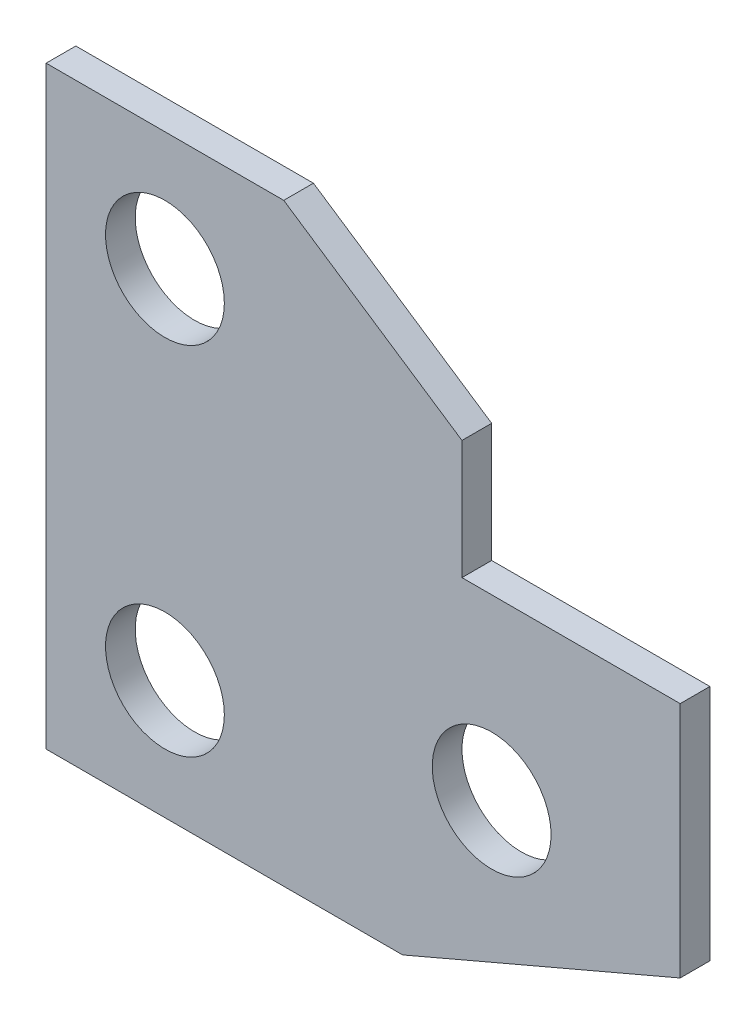
ISO-10303-21;
HEADER;
FILE_DESCRIPTION(('STEP AP214'),'2;1');
FILE_NAME('part.step','',(''),(''),'','','');
FILE_SCHEMA(('AUTOMOTIVE_DESIGN { 1 0 10303 214 1 1 1 1 }'));
ENDSEC;
DATA;
#1=APPLICATION_CONTEXT('core data for automotive mechanical design processes');
#2=APPLICATION_PROTOCOL_DEFINITION('international standard','automotive_design',2000,#1);
#3=PRODUCT_CONTEXT('',#1,'mechanical');
#4=PRODUCT('Part','Part','',(#3));
#5=PRODUCT_RELATED_PRODUCT_CATEGORY('part','',(#4));
#6=PRODUCT_DEFINITION_FORMATION('','',#4);
#7=PRODUCT_DEFINITION_CONTEXT('part definition',#1,'design');
#8=PRODUCT_DEFINITION('design','',#6,#7);
#9=PRODUCT_DEFINITION_SHAPE('','',#8);
#10=(LENGTH_UNIT() NAMED_UNIT(*) SI_UNIT(.MILLI.,.METRE.));
#11=(NAMED_UNIT(*) PLANE_ANGLE_UNIT() SI_UNIT($,.RADIAN.));
#12=(NAMED_UNIT(*) SI_UNIT($,.STERADIAN.) SOLID_ANGLE_UNIT());
#13=UNCERTAINTY_MEASURE_WITH_UNIT(LENGTH_MEASURE(1.E-05),#10,'distance_accuracy_value','');
#14=(GEOMETRIC_REPRESENTATION_CONTEXT(3) GLOBAL_UNCERTAINTY_ASSIGNED_CONTEXT((#13)) GLOBAL_UNIT_ASSIGNED_CONTEXT((#10,
#11,#12)) REPRESENTATION_CONTEXT('',''));
#15=CARTESIAN_POINT('',(0.,0.,0.));
#16=DIRECTION('',(0.,0.,1.));
#17=DIRECTION('',(1.,0.,0.));
#18=AXIS2_PLACEMENT_3D('',#15,#16,#17);
#19=CARTESIAN_POINT('',(0.,0.,5.));
#20=DIRECTION('',(0.,0.,-1.));
#21=DIRECTION('',(-1.,0.,0.));
#22=AXIS2_PLACEMENT_3D('',#19,#20,#21);
#23=PLANE('',#22);
#24=DIRECTION('',(0.,-1.,0.));
#25=VECTOR('',#24,1.);
#26=CARTESIAN_POINT('',(-146.847208950669,6.23541792753066,5.));
#27=LINE('',#26,#25);
#28=CARTESIAN_POINT('',(-146.847208950669,106.235417927531,5.));
#29=VERTEX_POINT('',#28);
#30=CARTESIAN_POINT('',(-146.847208950669,6.23541792753066,5.));
#31=VERTEX_POINT('',#30);
#32=EDGE_CURVE('E168',#29,#31,#27,.T.);
#33=ORIENTED_EDGE('',*,*,#32,.T.);
#34=DIRECTION('',(1.,0.,0.));
#35=VECTOR('',#34,1.);
#36=CARTESIAN_POINT('',(-86.8472089506691,6.23541792753067,5.));
#37=LINE('',#36,#35);
#38=CARTESIAN_POINT('',(-86.8472089506691,6.23541792753067,5.));
#39=VERTEX_POINT('',#38);
#40=EDGE_CURVE('E104',#31,#39,#37,.T.);
#41=ORIENTED_EDGE('',*,*,#40,.T.);
#42=DIRECTION('',(0.919347733087275,0.393445988246531,0.));
#43=VECTOR('',#42,1.);
#44=CARTESIAN_POINT('',(-40.1140989151835,26.2354179275307,5.));
#45=LINE('',#44,#43);
#46=CARTESIAN_POINT('',(-40.1140989151835,26.2354179275307,5.));
#47=VERTEX_POINT('',#46);
#48=EDGE_CURVE('E189',#39,#47,#45,.T.);
#49=ORIENTED_EDGE('',*,*,#48,.T.);
#50=DIRECTION('',(0.,1.,0.));
#51=VECTOR('',#50,1.);
#52=CARTESIAN_POINT('',(-40.1140989151835,66.2354179275307,5.));
#53=LINE('',#52,#51);
#54=CARTESIAN_POINT('',(-40.1140989151835,66.2354179275307,5.));
#55=VERTEX_POINT('',#54);
#56=EDGE_CURVE('E203',#47,#55,#53,.T.);
#57=ORIENTED_EDGE('',*,*,#56,.T.);
#58=DIRECTION('',(-1.,0.,0.));
#59=VECTOR('',#58,1.);
#60=CARTESIAN_POINT('',(-76.8472089506691,66.2354179275307,5.));
#61=LINE('',#60,#59);
#62=CARTESIAN_POINT('',(-76.8472089506691,66.2354179275307,5.));
#63=VERTEX_POINT('',#62);
#64=EDGE_CURVE('E123',#55,#63,#61,.T.);
#65=ORIENTED_EDGE('',*,*,#64,.T.);
#66=DIRECTION('',(0.,1.,0.));
#67=VECTOR('',#66,1.);
#68=CARTESIAN_POINT('',(-76.8472089506691,86.2354179275307,5.));
#69=LINE('',#68,#67);
#70=CARTESIAN_POINT('',(-76.8472089506691,86.2354179275307,5.));
#71=VERTEX_POINT('',#70);
#72=EDGE_CURVE('E117',#63,#71,#69,.T.);
#73=ORIENTED_EDGE('',*,*,#72,.T.);
#74=DIRECTION('',(-0.832050294337843,0.554700196225229,0.));
#75=VECTOR('',#74,1.);
#76=CARTESIAN_POINT('',(-106.847208950669,106.235417927531,5.));
#77=LINE('',#76,#75);
#78=CARTESIAN_POINT('',(-106.847208950669,106.235417927531,5.));
#79=VERTEX_POINT('',#78);
#80=EDGE_CURVE('E121',#71,#79,#77,.T.);
#81=ORIENTED_EDGE('',*,*,#80,.T.);
#82=DIRECTION('',(-1.,0.,0.));
#83=VECTOR('',#82,1.);
#84=CARTESIAN_POINT('',(-146.847208950669,106.235417927531,5.));
#85=LINE('',#84,#83);
#86=EDGE_CURVE('E61',#79,#29,#85,.T.);
#87=ORIENTED_EDGE('',*,*,#86,.T.);
#88=EDGE_LOOP('',(#33,#41,#49,#57,#65,#73,#81,#87));
#89=FACE_BOUND('',#88,.T.);
#90=CARTESIAN_POINT('',(-126.847208950669,86.2354179275307,5.));
#91=DIRECTION('',(0.,0.,1.));
#92=DIRECTION('',(1.,0.,0.));
#93=AXIS2_PLACEMENT_3D('',#90,#91,#92);
#94=CIRCLE('',#93,9.99999999999999);
#95=CARTESIAN_POINT('',(-116.847208950669,86.2354179275307,5.));
#96=VERTEX_POINT('',#95);
#97=EDGE_CURVE('E150',#96,#96,#94,.T.);
#98=ORIENTED_EDGE('',*,*,#97,.F.);
#99=EDGE_LOOP('',(#98));
#100=FACE_BOUND('',#99,.T.);
#101=CARTESIAN_POINT('',(-126.847208950669,26.2354179275307,5.));
#102=DIRECTION('',(0.,0.,1.));
#103=DIRECTION('',(1.,0.,0.));
#104=AXIS2_PLACEMENT_3D('',#101,#102,#103);
#105=CIRCLE('',#104,9.99999999999999);
#106=CARTESIAN_POINT('',(-116.847208950669,26.2354179275307,5.));
#107=VERTEX_POINT('',#106);
#108=EDGE_CURVE('E217',#107,#107,#105,.T.);
#109=ORIENTED_EDGE('',*,*,#108,.F.);
#110=EDGE_LOOP('',(#109));
#111=FACE_BOUND('',#110,.T.);
#112=CARTESIAN_POINT('',(-71.8472089506691,36.2354179275307,5.));
#113=DIRECTION('',(0.,0.,1.));
#114=DIRECTION('',(1.,0.,0.));
#115=AXIS2_PLACEMENT_3D('',#112,#113,#114);
#116=CIRCLE('',#115,10.);
#117=CARTESIAN_POINT('',(-61.8472089506691,36.2354179275307,5.));
#118=VERTEX_POINT('',#117);
#119=EDGE_CURVE('E225',#118,#118,#116,.T.);
#120=ORIENTED_EDGE('',*,*,#119,.F.);
#121=EDGE_LOOP('',(#120));
#122=FACE_BOUND('',#121,.T.);
#123=ADVANCED_FACE('F43',(#89,#100,#111,#122),#23,.F.);
#124=CARTESIAN_POINT('',(0.,0.,0.));
#125=DIRECTION('',(0.,0.,-1.));
#126=DIRECTION('',(-1.,0.,0.));
#127=AXIS2_PLACEMENT_3D('',#124,#125,#126);
#128=PLANE('',#127);
#129=CARTESIAN_POINT('',(-126.847208950669,26.2354179275307,0.));
#130=DIRECTION('',(0.,0.,1.));
#131=DIRECTION('',(1.,0.,0.));
#132=AXIS2_PLACEMENT_3D('',#129,#130,#131);
#133=CIRCLE('',#132,9.99999999999999);
#134=CARTESIAN_POINT('',(-116.847208950669,26.2354179275307,0.));
#135=VERTEX_POINT('',#134);
#136=EDGE_CURVE('E221',#135,#135,#133,.T.);
#137=ORIENTED_EDGE('',*,*,#136,.T.);
#138=EDGE_LOOP('',(#137));
#139=FACE_BOUND('',#138,.T.);
#140=DIRECTION('',(0.,-1.,0.));
#141=VECTOR('',#140,1.);
#142=CARTESIAN_POINT('',(-146.847208950669,6.23541792753066,0.));
#143=LINE('',#142,#141);
#144=CARTESIAN_POINT('',(-146.847208950669,106.235417927531,0.));
#145=VERTEX_POINT('',#144);
#146=CARTESIAN_POINT('',(-146.847208950669,6.23541792753066,0.));
#147=VERTEX_POINT('',#146);
#148=EDGE_CURVE('E145',#145,#147,#143,.T.);
#149=ORIENTED_EDGE('',*,*,#148,.F.);
#150=DIRECTION('',(-1.,0.,0.));
#151=VECTOR('',#150,1.);
#152=CARTESIAN_POINT('',(-146.847208950669,106.235417927531,0.));
#153=LINE('',#152,#151);
#154=CARTESIAN_POINT('',(-106.847208950669,106.235417927531,0.));
#155=VERTEX_POINT('',#154);
#156=EDGE_CURVE('E96',#155,#145,#153,.T.);
#157=ORIENTED_EDGE('',*,*,#156,.F.);
#158=DIRECTION('',(-0.832050294337843,0.554700196225229,0.));
#159=VECTOR('',#158,1.);
#160=CARTESIAN_POINT('',(-106.847208950669,106.235417927531,0.));
#161=LINE('',#160,#159);
#162=CARTESIAN_POINT('',(-76.8472089506691,86.2354179275307,0.));
#163=VERTEX_POINT('',#162);
#164=EDGE_CURVE('E90',#163,#155,#161,.T.);
#165=ORIENTED_EDGE('',*,*,#164,.F.);
#166=DIRECTION('',(0.,1.,0.));
#167=VECTOR('',#166,1.);
#168=CARTESIAN_POINT('',(-76.8472089506691,86.2354179275307,0.));
#169=LINE('',#168,#167);
#170=CARTESIAN_POINT('',(-76.8472089506691,66.2354179275307,0.));
#171=VERTEX_POINT('',#170);
#172=EDGE_CURVE('E132',#171,#163,#169,.T.);
#173=ORIENTED_EDGE('',*,*,#172,.F.);
#174=DIRECTION('',(-1.,0.,0.));
#175=VECTOR('',#174,1.);
#176=CARTESIAN_POINT('',(-76.8472089506691,66.2354179275307,0.));
#177=LINE('',#176,#175);
#178=CARTESIAN_POINT('',(-40.1140989151835,66.2354179275307,0.));
#179=VERTEX_POINT('',#178);
#180=EDGE_CURVE('E159',#179,#171,#177,.T.);
#181=ORIENTED_EDGE('',*,*,#180,.F.);
#182=DIRECTION('',(0.,1.,0.));
#183=VECTOR('',#182,1.);
#184=CARTESIAN_POINT('',(-40.1140989151835,66.2354179275307,0.));
#185=LINE('',#184,#183);
#186=CARTESIAN_POINT('',(-40.1140989151835,26.2354179275307,0.));
#187=VERTEX_POINT('',#186);
#188=EDGE_CURVE('E156',#187,#179,#185,.T.);
#189=ORIENTED_EDGE('',*,*,#188,.F.);
#190=DIRECTION('',(0.919347733087275,0.393445988246531,0.));
#191=VECTOR('',#190,1.);
#192=CARTESIAN_POINT('',(-40.1140989151835,26.2354179275307,0.));
#193=LINE('',#192,#191);
#194=CARTESIAN_POINT('',(-86.8472089506691,6.23541792753067,0.));
#195=VERTEX_POINT('',#194);
#196=EDGE_CURVE('E153',#195,#187,#193,.T.);
#197=ORIENTED_EDGE('',*,*,#196,.F.);
#198=DIRECTION('',(1.,0.,0.));
#199=VECTOR('',#198,1.);
#200=CARTESIAN_POINT('',(-86.8472089506691,6.23541792753067,0.));
#201=LINE('',#200,#199);
#202=EDGE_CURVE('E149',#147,#195,#201,.T.);
#203=ORIENTED_EDGE('',*,*,#202,.F.);
#204=EDGE_LOOP('',(#149,#157,#165,#173,#181,#189,#197,#203));
#205=FACE_BOUND('',#204,.T.);
#206=CARTESIAN_POINT('',(-126.847208950669,86.2354179275307,0.));
#207=DIRECTION('',(0.,0.,1.));
#208=DIRECTION('',(1.,0.,0.));
#209=AXIS2_PLACEMENT_3D('',#206,#207,#208);
#210=CIRCLE('',#209,9.99999999999999);
#211=CARTESIAN_POINT('',(-116.847208950669,86.2354179275307,0.));
#212=VERTEX_POINT('',#211);
#213=EDGE_CURVE('E213',#212,#212,#210,.T.);
#214=ORIENTED_EDGE('',*,*,#213,.T.);
#215=EDGE_LOOP('',(#214));
#216=FACE_BOUND('',#215,.T.);
#217=CARTESIAN_POINT('',(-71.8472089506691,36.2354179275307,0.));
#218=DIRECTION('',(0.,0.,1.));
#219=DIRECTION('',(1.,0.,0.));
#220=AXIS2_PLACEMENT_3D('',#217,#218,#219);
#221=CIRCLE('',#220,10.);
#222=CARTESIAN_POINT('',(-61.8472089506691,36.2354179275307,0.));
#223=VERTEX_POINT('',#222);
#224=EDGE_CURVE('E229',#223,#223,#221,.T.);
#225=ORIENTED_EDGE('',*,*,#224,.T.);
#226=EDGE_LOOP('',(#225));
#227=FACE_BOUND('',#226,.T.);
#228=ADVANCED_FACE('F193',(#139,#205,#216,#227),#128,.T.);
#229=CARTESIAN_POINT('',(-146.847208950669,6.23541792753066,5.));
#230=DIRECTION('',(1.,0.,0.));
#231=DIRECTION('',(0.,0.,-1.));
#232=AXIS2_PLACEMENT_3D('',#229,#230,#231);
#233=PLANE('',#232);
#234=ORIENTED_EDGE('',*,*,#148,.T.);
#235=DIRECTION('',(0.,0.,-1.));
#236=VECTOR('',#235,1.);
#237=CARTESIAN_POINT('',(-146.847208950669,6.23541792753066,5.));
#238=LINE('',#237,#236);
#239=EDGE_CURVE('E11',#31,#147,#238,.T.);
#240=ORIENTED_EDGE('',*,*,#239,.F.);
#241=ORIENTED_EDGE('',*,*,#32,.F.);
#242=DIRECTION('',(0.,0.,-1.));
#243=VECTOR('',#242,1.);
#244=CARTESIAN_POINT('',(-146.847208950669,106.235417927531,5.));
#245=LINE('',#244,#243);
#246=EDGE_CURVE('E141',#29,#145,#245,.T.);
#247=ORIENTED_EDGE('',*,*,#246,.T.);
#248=EDGE_LOOP('',(#234,#240,#241,#247));
#249=FACE_BOUND('',#248,.T.);
#250=ADVANCED_FACE('F45',(#249),#233,.F.);
#251=CARTESIAN_POINT('',(-86.8472089506691,6.23541792753067,5.));
#252=DIRECTION('',(0.,1.,0.));
#253=DIRECTION('',(-1.,0.,0.));
#254=AXIS2_PLACEMENT_3D('',#251,#252,#253);
#255=PLANE('',#254);
#256=ORIENTED_EDGE('',*,*,#202,.T.);
#257=DIRECTION('',(0.,0.,-1.));
#258=VECTOR('',#257,1.);
#259=CARTESIAN_POINT('',(-86.8472089506691,6.23541792753067,5.));
#260=LINE('',#259,#258);
#261=EDGE_CURVE('E53',#39,#195,#260,.T.);
#262=ORIENTED_EDGE('',*,*,#261,.F.);
#263=ORIENTED_EDGE('',*,*,#40,.F.);
#264=ORIENTED_EDGE('',*,*,#239,.T.);
#265=EDGE_LOOP('',(#256,#262,#263,#264));
#266=FACE_BOUND('',#265,.T.);
#267=ADVANCED_FACE('F263',(#266),#255,.F.);
#268=CARTESIAN_POINT('',(-40.1140989151835,26.2354179275307,5.));
#269=DIRECTION('',(-0.393445988246531,0.919347733087275,0.));
#270=DIRECTION('',(-0.919347733087275,-0.393445988246531,0.));
#271=AXIS2_PLACEMENT_3D('',#268,#269,#270);
#272=PLANE('',#271);
#273=ORIENTED_EDGE('',*,*,#196,.T.);
#274=DIRECTION('',(0.,0.,-1.));
#275=VECTOR('',#274,1.);
#276=CARTESIAN_POINT('',(-40.1140989151835,26.2354179275307,5.));
#277=LINE('',#276,#275);
#278=EDGE_CURVE('E179',#47,#187,#277,.T.);
#279=ORIENTED_EDGE('',*,*,#278,.F.);
#280=ORIENTED_EDGE('',*,*,#48,.F.);
#281=ORIENTED_EDGE('',*,*,#261,.T.);
#282=EDGE_LOOP('',(#273,#279,#280,#281));
#283=FACE_BOUND('',#282,.T.);
#284=ADVANCED_FACE('F187',(#283),#272,.F.);
#285=CARTESIAN_POINT('',(-40.1140989151835,66.2354179275307,5.));
#286=DIRECTION('',(-1.,0.,0.));
#287=DIRECTION('',(0.,-1.,0.));
#288=AXIS2_PLACEMENT_3D('',#285,#286,#287);
#289=PLANE('',#288);
#290=ORIENTED_EDGE('',*,*,#188,.T.);
#291=DIRECTION('',(0.,0.,-1.));
#292=VECTOR('',#291,1.);
#293=CARTESIAN_POINT('',(-40.1140989151835,66.2354179275307,5.));
#294=LINE('',#293,#292);
#295=EDGE_CURVE('E175',#55,#179,#294,.T.);
#296=ORIENTED_EDGE('',*,*,#295,.F.);
#297=ORIENTED_EDGE('',*,*,#56,.F.);
#298=ORIENTED_EDGE('',*,*,#278,.T.);
#299=EDGE_LOOP('',(#290,#296,#297,#298));
#300=FACE_BOUND('',#299,.T.);
#301=ADVANCED_FACE('F198',(#300),#289,.F.);
#302=CARTESIAN_POINT('',(-76.8472089506691,66.2354179275307,5.));
#303=DIRECTION('',(0.,-1.,0.));
#304=DIRECTION('',(0.,0.,-1.));
#305=AXIS2_PLACEMENT_3D('',#302,#303,#304);
#306=PLANE('',#305);
#307=ORIENTED_EDGE('',*,*,#180,.T.);
#308=DIRECTION('',(0.,0.,-1.));
#309=VECTOR('',#308,1.);
#310=CARTESIAN_POINT('',(-76.8472089506691,66.2354179275307,5.));
#311=LINE('',#310,#309);
#312=EDGE_CURVE('E134',#63,#171,#311,.T.);
#313=ORIENTED_EDGE('',*,*,#312,.F.);
#314=ORIENTED_EDGE('',*,*,#64,.F.);
#315=ORIENTED_EDGE('',*,*,#295,.T.);
#316=EDGE_LOOP('',(#307,#313,#314,#315));
#317=FACE_BOUND('',#316,.T.);
#318=ADVANCED_FACE('F201',(#317),#306,.F.);
#319=CARTESIAN_POINT('',(-76.8472089506691,86.2354179275307,5.));
#320=DIRECTION('',(-1.,0.,0.));
#321=DIRECTION('',(0.,0.,1.));
#322=AXIS2_PLACEMENT_3D('',#319,#320,#321);
#323=PLANE('',#322);
#324=ORIENTED_EDGE('',*,*,#172,.T.);
#325=DIRECTION('',(0.,0.,-1.));
#326=VECTOR('',#325,1.);
#327=CARTESIAN_POINT('',(-76.8472089506691,86.2354179275307,5.));
#328=LINE('',#327,#326);
#329=EDGE_CURVE('E129',#71,#163,#328,.T.);
#330=ORIENTED_EDGE('',*,*,#329,.F.);
#331=ORIENTED_EDGE('',*,*,#72,.F.);
#332=ORIENTED_EDGE('',*,*,#312,.T.);
#333=EDGE_LOOP('',(#324,#330,#331,#332));
#334=FACE_BOUND('',#333,.T.);
#335=ADVANCED_FACE('F130',(#334),#323,.F.);
#336=CARTESIAN_POINT('',(-106.847208950669,106.235417927531,5.));
#337=DIRECTION('',(-0.554700196225229,-0.832050294337844,0.));
#338=DIRECTION('',(0.832050294337844,-0.554700196225229,0.));
#339=AXIS2_PLACEMENT_3D('',#336,#337,#338);
#340=PLANE('',#339);
#341=ORIENTED_EDGE('',*,*,#164,.T.);
#342=DIRECTION('',(0.,0.,-1.));
#343=VECTOR('',#342,1.);
#344=CARTESIAN_POINT('',(-106.847208950669,106.235417927531,5.));
#345=LINE('',#344,#343);
#346=EDGE_CURVE('E135',#79,#155,#345,.T.);
#347=ORIENTED_EDGE('',*,*,#346,.F.);
#348=ORIENTED_EDGE('',*,*,#80,.F.);
#349=ORIENTED_EDGE('',*,*,#329,.T.);
#350=EDGE_LOOP('',(#341,#347,#348,#349));
#351=FACE_BOUND('',#350,.T.);
#352=ADVANCED_FACE('F137',(#351),#340,.F.);
#353=CARTESIAN_POINT('',(-146.847208950669,106.235417927531,5.));
#354=DIRECTION('',(0.,-1.,0.));
#355=DIRECTION('',(0.,0.,-1.));
#356=AXIS2_PLACEMENT_3D('',#353,#354,#355);
#357=PLANE('',#356);
#358=ORIENTED_EDGE('',*,*,#156,.T.);
#359=ORIENTED_EDGE('',*,*,#246,.F.);
#360=ORIENTED_EDGE('',*,*,#86,.F.);
#361=ORIENTED_EDGE('',*,*,#346,.T.);
#362=EDGE_LOOP('',(#358,#359,#360,#361));
#363=FACE_BOUND('',#362,.T.);
#364=ADVANCED_FACE('F251',(#363),#357,.F.);
#365=CARTESIAN_POINT('',(-126.847208950669,86.2354179275307,5.));
#366=DIRECTION('',(0.,0.,-1.));
#367=DIRECTION('',(-1.,0.,0.));
#368=AXIS2_PLACEMENT_3D('',#365,#366,#367);
#369=CYLINDRICAL_SURFACE('',#368,9.99999999999999);
#370=ORIENTED_EDGE('',*,*,#97,.T.);
#371=EDGE_LOOP('',(#370));
#372=FACE_BOUND('',#371,.T.);
#373=ORIENTED_EDGE('',*,*,#213,.F.);
#374=EDGE_LOOP('',(#373));
#375=FACE_BOUND('',#374,.T.);
#376=ADVANCED_FACE('F248',(#372,#375),#369,.F.);
#377=CARTESIAN_POINT('',(-126.847208950669,26.2354179275307,5.));
#378=DIRECTION('',(0.,0.,-1.));
#379=DIRECTION('',(-1.,0.,0.));
#380=AXIS2_PLACEMENT_3D('',#377,#378,#379);
#381=CYLINDRICAL_SURFACE('',#380,9.99999999999999);
#382=ORIENTED_EDGE('',*,*,#108,.T.);
#383=EDGE_LOOP('',(#382));
#384=FACE_BOUND('',#383,.T.);
#385=ORIENTED_EDGE('',*,*,#136,.F.);
#386=EDGE_LOOP('',(#385));
#387=FACE_BOUND('',#386,.T.);
#388=ADVANCED_FACE('F339',(#384,#387),#381,.F.);
#389=CARTESIAN_POINT('',(-71.8472089506691,36.2354179275307,5.));
#390=DIRECTION('',(0.,0.,-1.));
#391=DIRECTION('',(-1.,0.,0.));
#392=AXIS2_PLACEMENT_3D('',#389,#390,#391);
#393=CYLINDRICAL_SURFACE('',#392,10.);
#394=ORIENTED_EDGE('',*,*,#119,.T.);
#395=EDGE_LOOP('',(#394));
#396=FACE_BOUND('',#395,.T.);
#397=ORIENTED_EDGE('',*,*,#224,.F.);
#398=EDGE_LOOP('',(#397));
#399=FACE_BOUND('',#398,.T.);
#400=ADVANCED_FACE('F237',(#396,#399),#393,.F.);
#401=CLOSED_SHELL('',(#123,#228,#250,#267,#284,#301,#318,#335,#352,#364,#376,#388,#400));
#402=MANIFOLD_SOLID_BREP('B2',#401);
#403=ADVANCED_BREP_SHAPE_REPRESENTATION('',(#18,#402),#14);
#404=SHAPE_DEFINITION_REPRESENTATION(#9,#403);
ENDSEC;
END-ISO-10303-21;
